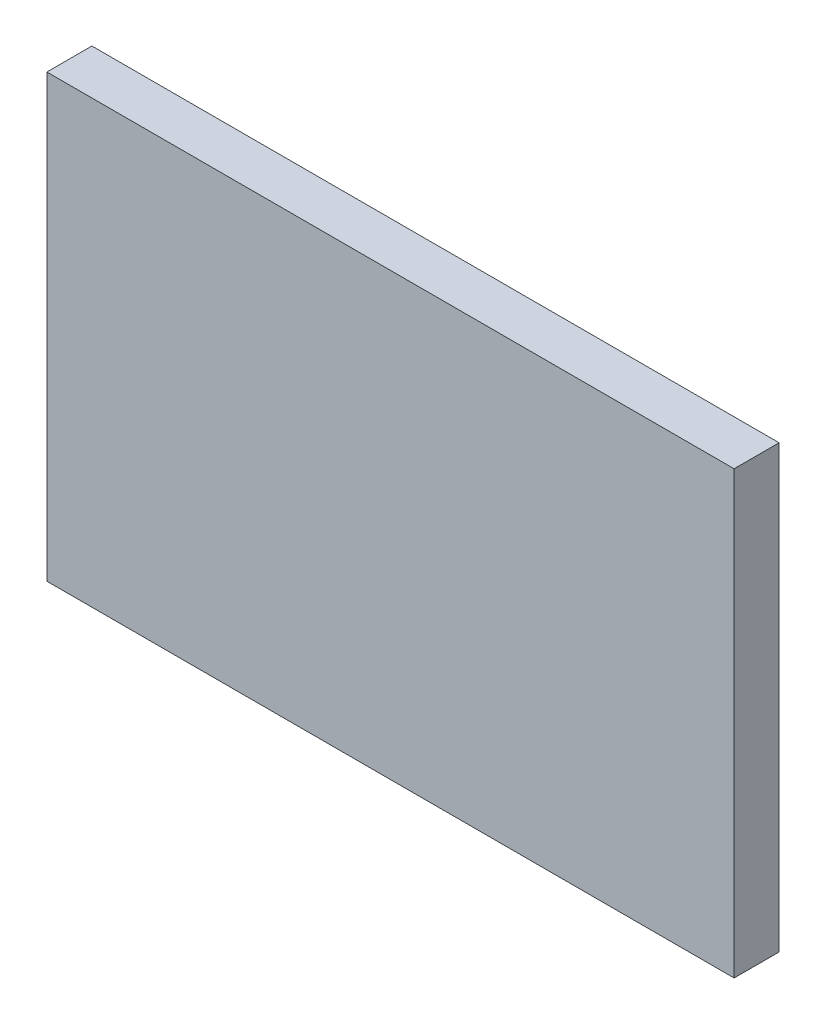
ISO-10303-21;
HEADER;
FILE_DESCRIPTION(('STEP AP214'),'2;1');
FILE_NAME('part.step','',(''),(''),'','','');
FILE_SCHEMA(('AUTOMOTIVE_DESIGN { 1 0 10303 214 1 1 1 1 }'));
ENDSEC;
DATA;
#1=APPLICATION_CONTEXT('core data for automotive mechanical design processes');
#2=APPLICATION_PROTOCOL_DEFINITION('international standard','automotive_design',2000,#1);
#3=PRODUCT_CONTEXT('',#1,'mechanical');
#4=PRODUCT('Part','Part','',(#3));
#5=PRODUCT_RELATED_PRODUCT_CATEGORY('part','',(#4));
#6=PRODUCT_DEFINITION_FORMATION('','',#4);
#7=PRODUCT_DEFINITION_CONTEXT('part definition',#1,'design');
#8=PRODUCT_DEFINITION('design','',#6,#7);
#9=PRODUCT_DEFINITION_SHAPE('','',#8);
#10=(LENGTH_UNIT() NAMED_UNIT(*) SI_UNIT(.MILLI.,.METRE.));
#11=(NAMED_UNIT(*) PLANE_ANGLE_UNIT() SI_UNIT($,.RADIAN.));
#12=(NAMED_UNIT(*) SI_UNIT($,.STERADIAN.) SOLID_ANGLE_UNIT());
#13=UNCERTAINTY_MEASURE_WITH_UNIT(LENGTH_MEASURE(1.E-05),#10,'distance_accuracy_value','');
#14=(GEOMETRIC_REPRESENTATION_CONTEXT(3) GLOBAL_UNCERTAINTY_ASSIGNED_CONTEXT((#13)) GLOBAL_UNIT_ASSIGNED_CONTEXT((#10,
#11,#12)) REPRESENTATION_CONTEXT('',''));
#15=CARTESIAN_POINT('',(0.,0.,0.));
#16=DIRECTION('',(0.,0.,1.));
#17=DIRECTION('',(1.,0.,0.));
#18=AXIS2_PLACEMENT_3D('',#15,#16,#17);
#19=CARTESIAN_POINT('',(94.996,-60.96,12.446));
#20=DIRECTION('',(-1.,0.,0.));
#21=DIRECTION('',(0.,0.,1.));
#22=AXIS2_PLACEMENT_3D('',#19,#20,#21);
#23=PLANE('',#22);
#24=DIRECTION('',(0.,1.,0.));
#25=VECTOR('',#24,1.);
#26=CARTESIAN_POINT('',(94.996,-60.96,0.));
#27=LINE('',#26,#25);
#28=CARTESIAN_POINT('',(94.996,-60.96,0.));
#29=VERTEX_POINT('',#28);
#30=CARTESIAN_POINT('',(94.996,60.96,0.));
#31=VERTEX_POINT('',#30);
#32=EDGE_CURVE('E104',#29,#31,#27,.T.);
#33=ORIENTED_EDGE('',*,*,#32,.T.);
#34=DIRECTION('',(0.,0.,-1.));
#35=VECTOR('',#34,1.);
#36=CARTESIAN_POINT('',(94.996,60.96,12.446));
#37=LINE('',#36,#35);
#38=CARTESIAN_POINT('',(94.996,60.96,12.446));
#39=VERTEX_POINT('',#38);
#40=EDGE_CURVE('E11',#39,#31,#37,.T.);
#41=ORIENTED_EDGE('',*,*,#40,.F.);
#42=DIRECTION('',(0.,1.,0.));
#43=VECTOR('',#42,1.);
#44=CARTESIAN_POINT('',(94.996,-60.96,12.446));
#45=LINE('',#44,#43);
#46=CARTESIAN_POINT('',(94.996,-60.96,12.446));
#47=VERTEX_POINT('',#46);
#48=EDGE_CURVE('E92',#47,#39,#45,.T.);
#49=ORIENTED_EDGE('',*,*,#48,.F.);
#50=DIRECTION('',(0.,0.,-1.));
#51=VECTOR('',#50,1.);
#52=CARTESIAN_POINT('',(94.996,-60.96,12.446));
#53=LINE('',#52,#51);
#54=EDGE_CURVE('E100',#47,#29,#53,.T.);
#55=ORIENTED_EDGE('',*,*,#54,.T.);
#56=EDGE_LOOP('',(#33,#41,#49,#55));
#57=FACE_BOUND('',#56,.T.);
#58=ADVANCED_FACE('F41',(#57),#23,.F.);
#59=CARTESIAN_POINT('',(-94.996,60.96,12.446));
#60=DIRECTION('',(0.,-1.,0.));
#61=DIRECTION('',(0.,0.,-1.));
#62=AXIS2_PLACEMENT_3D('',#59,#60,#61);
#63=PLANE('',#62);
#64=DIRECTION('',(-1.,0.,0.));
#65=VECTOR('',#64,1.);
#66=CARTESIAN_POINT('',(-94.996,60.96,0.));
#67=LINE('',#66,#65);
#68=CARTESIAN_POINT('',(-94.996,60.96,0.));
#69=VERTEX_POINT('',#68);
#70=EDGE_CURVE('E96',#31,#69,#67,.T.);
#71=ORIENTED_EDGE('',*,*,#70,.T.);
#72=DIRECTION('',(0.,0.,-1.));
#73=VECTOR('',#72,1.);
#74=CARTESIAN_POINT('',(-94.996,60.96,12.446));
#75=LINE('',#74,#73);
#76=CARTESIAN_POINT('',(-94.996,60.96,12.446));
#77=VERTEX_POINT('',#76);
#78=EDGE_CURVE('E49',#77,#69,#75,.T.);
#79=ORIENTED_EDGE('',*,*,#78,.F.);
#80=DIRECTION('',(-1.,0.,0.));
#81=VECTOR('',#80,1.);
#82=CARTESIAN_POINT('',(-94.996,60.96,12.446));
#83=LINE('',#82,#81);
#84=EDGE_CURVE('E87',#39,#77,#83,.T.);
#85=ORIENTED_EDGE('',*,*,#84,.F.);
#86=ORIENTED_EDGE('',*,*,#40,.T.);
#87=EDGE_LOOP('',(#71,#79,#85,#86));
#88=FACE_BOUND('',#87,.T.);
#89=ADVANCED_FACE('F95',(#88),#63,.F.);
#90=CARTESIAN_POINT('',(-94.996,-60.96,12.446));
#91=DIRECTION('',(1.,0.,0.));
#92=DIRECTION('',(0.,0.,-1.));
#93=AXIS2_PLACEMENT_3D('',#90,#91,#92);
#94=PLANE('',#93);
#95=DIRECTION('',(0.,-1.,0.));
#96=VECTOR('',#95,1.);
#97=CARTESIAN_POINT('',(-94.996,-60.96,0.));
#98=LINE('',#97,#96);
#99=CARTESIAN_POINT('',(-94.996,-60.96,0.));
#100=VERTEX_POINT('',#99);
#101=EDGE_CURVE('E74',#69,#100,#98,.T.);
#102=ORIENTED_EDGE('',*,*,#101,.T.);
#103=DIRECTION('',(0.,0.,-1.));
#104=VECTOR('',#103,1.);
#105=CARTESIAN_POINT('',(-94.996,-60.96,12.446));
#106=LINE('',#105,#104);
#107=CARTESIAN_POINT('',(-94.996,-60.96,12.446));
#108=VERTEX_POINT('',#107);
#109=EDGE_CURVE('E97',#108,#100,#106,.T.);
#110=ORIENTED_EDGE('',*,*,#109,.F.);
#111=DIRECTION('',(0.,-1.,0.));
#112=VECTOR('',#111,1.);
#113=CARTESIAN_POINT('',(-94.996,-60.96,12.446));
#114=LINE('',#113,#112);
#115=EDGE_CURVE('E90',#77,#108,#114,.T.);
#116=ORIENTED_EDGE('',*,*,#115,.F.);
#117=ORIENTED_EDGE('',*,*,#78,.T.);
#118=EDGE_LOOP('',(#102,#110,#116,#117));
#119=FACE_BOUND('',#118,.T.);
#120=ADVANCED_FACE('F98',(#119),#94,.F.);
#121=CARTESIAN_POINT('',(-94.996,-60.96,12.446));
#122=DIRECTION('',(0.,1.,0.));
#123=DIRECTION('',(0.,0.,1.));
#124=AXIS2_PLACEMENT_3D('',#121,#122,#123);
#125=PLANE('',#124);
#126=DIRECTION('',(1.,0.,0.));
#127=VECTOR('',#126,1.);
#128=CARTESIAN_POINT('',(-94.996,-60.96,0.));
#129=LINE('',#128,#127);
#130=EDGE_CURVE('E80',#100,#29,#129,.T.);
#131=ORIENTED_EDGE('',*,*,#130,.T.);
#132=ORIENTED_EDGE('',*,*,#54,.F.);
#133=DIRECTION('',(1.,0.,0.));
#134=VECTOR('',#133,1.);
#135=CARTESIAN_POINT('',(-94.996,-60.96,12.446));
#136=LINE('',#135,#134);
#137=EDGE_CURVE('E57',#108,#47,#136,.T.);
#138=ORIENTED_EDGE('',*,*,#137,.F.);
#139=ORIENTED_EDGE('',*,*,#109,.T.);
#140=EDGE_LOOP('',(#131,#132,#138,#139));
#141=FACE_BOUND('',#140,.T.);
#142=ADVANCED_FACE('F111',(#141),#125,.F.);
#143=CARTESIAN_POINT('',(0.,0.,12.446));
#144=DIRECTION('',(0.,0.,-1.));
#145=DIRECTION('',(-1.,0.,0.));
#146=AXIS2_PLACEMENT_3D('',#143,#144,#145);
#147=PLANE('',#146);
#148=ORIENTED_EDGE('',*,*,#48,.T.);
#149=ORIENTED_EDGE('',*,*,#84,.T.);
#150=ORIENTED_EDGE('',*,*,#115,.T.);
#151=ORIENTED_EDGE('',*,*,#137,.T.);
#152=EDGE_LOOP('',(#148,#149,#150,#151));
#153=FACE_BOUND('',#152,.T.);
#154=ADVANCED_FACE('F88',(#153),#147,.F.);
#155=CARTESIAN_POINT('',(0.,0.,0.));
#156=DIRECTION('',(0.,0.,-1.));
#157=DIRECTION('',(-1.,0.,0.));
#158=AXIS2_PLACEMENT_3D('',#155,#156,#157);
#159=PLANE('',#158);
#160=ORIENTED_EDGE('',*,*,#32,.F.);
#161=ORIENTED_EDGE('',*,*,#130,.F.);
#162=ORIENTED_EDGE('',*,*,#101,.F.);
#163=ORIENTED_EDGE('',*,*,#70,.F.);
#164=EDGE_LOOP('',(#160,#161,#162,#163));
#165=FACE_BOUND('',#164,.T.);
#166=ADVANCED_FACE('F114',(#165),#159,.T.);
#167=CLOSED_SHELL('',(#58,#89,#120,#142,#154,#166));
#168=MANIFOLD_SOLID_BREP('B2',#167);
#169=ADVANCED_BREP_SHAPE_REPRESENTATION('',(#18,#168),#14);
#170=SHAPE_DEFINITION_REPRESENTATION(#9,#169);
ENDSEC;
END-ISO-10303-21;
